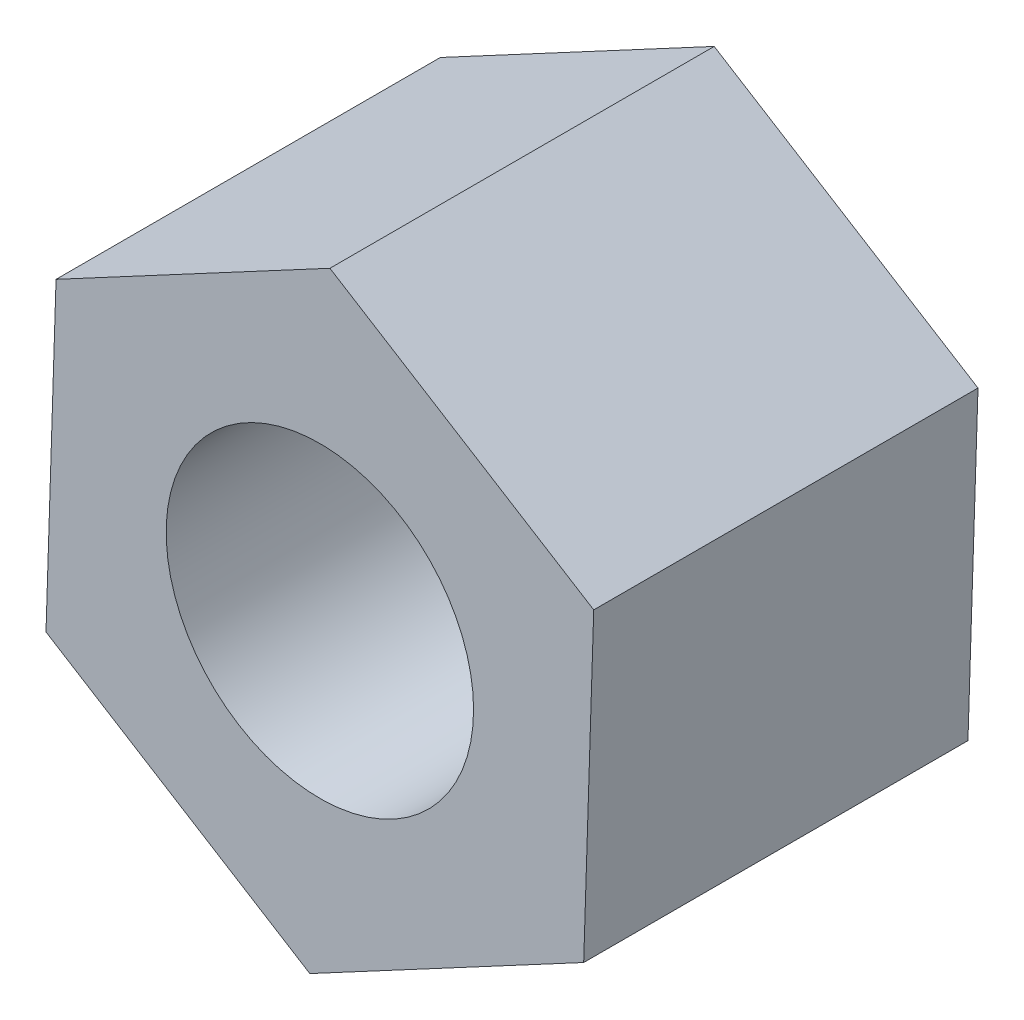
ISO-10303-21;
HEADER;
FILE_DESCRIPTION(('STEP AP214'),'2;1');
FILE_NAME('part.step','',(''),(''),'','','');
FILE_SCHEMA(('AUTOMOTIVE_DESIGN { 1 0 10303 214 1 1 1 1 }'));
ENDSEC;
DATA;
#1=APPLICATION_CONTEXT('core data for automotive mechanical design processes');
#2=APPLICATION_PROTOCOL_DEFINITION('international standard','automotive_design',2000,#1);
#3=PRODUCT_CONTEXT('',#1,'mechanical');
#4=PRODUCT('Part','Part','',(#3));
#5=PRODUCT_RELATED_PRODUCT_CATEGORY('part','',(#4));
#6=PRODUCT_DEFINITION_FORMATION('','',#4);
#7=PRODUCT_DEFINITION_CONTEXT('part definition',#1,'design');
#8=PRODUCT_DEFINITION('design','',#6,#7);
#9=PRODUCT_DEFINITION_SHAPE('','',#8);
#10=(LENGTH_UNIT() NAMED_UNIT(*) SI_UNIT(.MILLI.,.METRE.));
#11=(NAMED_UNIT(*) PLANE_ANGLE_UNIT() SI_UNIT($,.RADIAN.));
#12=(NAMED_UNIT(*) SI_UNIT($,.STERADIAN.) SOLID_ANGLE_UNIT());
#13=UNCERTAINTY_MEASURE_WITH_UNIT(LENGTH_MEASURE(1.E-05),#10,'distance_accuracy_value','');
#14=(GEOMETRIC_REPRESENTATION_CONTEXT(3) GLOBAL_UNCERTAINTY_ASSIGNED_CONTEXT((#13)) GLOBAL_UNIT_ASSIGNED_CONTEXT((#10,
#11,#12)) REPRESENTATION_CONTEXT('',''));
#15=CARTESIAN_POINT('',(0.,0.,0.));
#16=DIRECTION('',(0.,0.,1.));
#17=DIRECTION('',(1.,0.,0.));
#18=AXIS2_PLACEMENT_3D('',#15,#16,#17);
#19=CARTESIAN_POINT('',(5.65719187726186,3.02633972765381,7.9375));
#20=DIRECTION('',(0.,0.,1.));
#21=DIRECTION('',(1.,0.,0.));
#22=AXIS2_PLACEMENT_3D('',#19,#20,#21);
#23=PLANE('',#22);
#24=DIRECTION('',(0.0323745591281024,0.999475806571255,0.));
#25=VECTOR('',#24,1.);
#26=CARTESIAN_POINT('',(5.44948302326121,-3.38610201596485,7.9375));
#27=LINE('',#26,#25);
#28=CARTESIAN_POINT('',(5.44948302326121,-3.38610201596485,7.9375));
#29=VERTEX_POINT('',#28);
#30=CARTESIAN_POINT('',(5.65719187726186,3.02633972765381,7.9375));
#31=VERTEX_POINT('',#30);
#32=EDGE_CURVE('E127',#29,#31,#27,.T.);
#33=ORIENTED_EDGE('',*,*,#32,.T.);
#34=DIRECTION('',(-0.849384159394598,0.527775093926886,0.));
#35=VECTOR('',#34,1.);
#36=CARTESIAN_POINT('',(5.65719187726186,3.02633972765381,7.9375));
#37=LINE('',#36,#35);
#38=CARTESIAN_POINT('',(0.207708854000655,6.41244174361865,7.9375));
#39=VERTEX_POINT('',#38);
#40=EDGE_CURVE('E85',#31,#39,#37,.T.);
#41=ORIENTED_EDGE('',*,*,#40,.T.);
#42=DIRECTION('',(-0.8817587185227,-0.471700712644369,0.));
#43=VECTOR('',#42,1.);
#44=CARTESIAN_POINT('',(0.207708854000655,6.41244174361865,7.9375));
#45=LINE('',#44,#43);
#46=CARTESIAN_POINT('',(-5.44948302326121,3.38610201596485,7.9375));
#47=VERTEX_POINT('',#46);
#48=EDGE_CURVE('E98',#39,#47,#45,.T.);
#49=ORIENTED_EDGE('',*,*,#48,.T.);
#50=DIRECTION('',(-0.0323745591281022,-0.999475806571255,0.));
#51=VECTOR('',#50,1.);
#52=CARTESIAN_POINT('',(-5.44948302326121,3.38610201596485,7.9375));
#53=LINE('',#52,#51);
#54=CARTESIAN_POINT('',(-5.65719187726186,-3.02633972765381,7.9375));
#55=VERTEX_POINT('',#54);
#56=EDGE_CURVE('E92',#47,#55,#53,.T.);
#57=ORIENTED_EDGE('',*,*,#56,.T.);
#58=DIRECTION('',(0.849384159394597,-0.527775093926886,0.));
#59=VECTOR('',#58,1.);
#60=CARTESIAN_POINT('',(-5.65719187726186,-3.02633972765381,7.9375));
#61=LINE('',#60,#59);
#62=CARTESIAN_POINT('',(-0.207708854000651,-6.41244174361865,7.9375));
#63=VERTEX_POINT('',#62);
#64=EDGE_CURVE('E96',#55,#63,#61,.T.);
#65=ORIENTED_EDGE('',*,*,#64,.T.);
#66=DIRECTION('',(0.8817587185227,0.471700712644369,0.));
#67=VECTOR('',#66,1.);
#68=CARTESIAN_POINT('',(-0.207708854000651,-6.41244174361865,7.9375));
#69=LINE('',#68,#67);
#70=EDGE_CURVE('E48',#63,#29,#69,.T.);
#71=ORIENTED_EDGE('',*,*,#70,.T.);
#72=EDGE_LOOP('',(#33,#41,#49,#57,#65,#71));
#73=FACE_BOUND('',#72,.T.);
#74=CARTESIAN_POINT('',(0.,0.,7.9375));
#75=DIRECTION('',(0.,0.,1.));
#76=DIRECTION('',(1.,0.,0.));
#77=AXIS2_PLACEMENT_3D('',#74,#75,#76);
#78=CIRCLE('',#77,3.175);
#79=CARTESIAN_POINT('',(3.175,0.,7.9375));
#80=VERTEX_POINT('',#79);
#81=EDGE_CURVE('E120',#80,#80,#78,.T.);
#82=ORIENTED_EDGE('',*,*,#81,.F.);
#83=EDGE_LOOP('',(#82));
#84=FACE_BOUND('',#83,.T.);
#85=ADVANCED_FACE('F31',(#73,#84),#23,.T.);
#86=CARTESIAN_POINT('',(5.65719187726186,3.02633972765381,0.));
#87=DIRECTION('',(0.,0.,1.));
#88=DIRECTION('',(1.,0.,0.));
#89=AXIS2_PLACEMENT_3D('',#86,#87,#88);
#90=PLANE('',#89);
#91=DIRECTION('',(0.0323745591281024,0.999475806571255,0.));
#92=VECTOR('',#91,1.);
#93=CARTESIAN_POINT('',(5.44948302326121,-3.38610201596485,0.));
#94=LINE('',#93,#92);
#95=CARTESIAN_POINT('',(5.44948302326121,-3.38610201596485,0.));
#96=VERTEX_POINT('',#95);
#97=CARTESIAN_POINT('',(5.65719187726186,3.02633972765381,0.));
#98=VERTEX_POINT('',#97);
#99=EDGE_CURVE('E116',#96,#98,#94,.T.);
#100=ORIENTED_EDGE('',*,*,#99,.F.);
#101=DIRECTION('',(0.8817587185227,0.471700712644369,0.));
#102=VECTOR('',#101,1.);
#103=CARTESIAN_POINT('',(-0.207708854000651,-6.41244174361865,0.));
#104=LINE('',#103,#102);
#105=CARTESIAN_POINT('',(-0.207708854000651,-6.41244174361865,0.));
#106=VERTEX_POINT('',#105);
#107=EDGE_CURVE('E77',#106,#96,#104,.T.);
#108=ORIENTED_EDGE('',*,*,#107,.F.);
#109=DIRECTION('',(0.849384159394597,-0.527775093926886,0.));
#110=VECTOR('',#109,1.);
#111=CARTESIAN_POINT('',(-5.65719187726186,-3.02633972765381,0.));
#112=LINE('',#111,#110);
#113=CARTESIAN_POINT('',(-5.65719187726186,-3.02633972765381,0.));
#114=VERTEX_POINT('',#113);
#115=EDGE_CURVE('E71',#114,#106,#112,.T.);
#116=ORIENTED_EDGE('',*,*,#115,.F.);
#117=DIRECTION('',(-0.0323745591281022,-0.999475806571255,0.));
#118=VECTOR('',#117,1.);
#119=CARTESIAN_POINT('',(-5.44948302326121,3.38610201596485,0.));
#120=LINE('',#119,#118);
#121=CARTESIAN_POINT('',(-5.44948302326121,3.38610201596485,0.));
#122=VERTEX_POINT('',#121);
#123=EDGE_CURVE('E106',#122,#114,#120,.T.);
#124=ORIENTED_EDGE('',*,*,#123,.F.);
#125=DIRECTION('',(-0.8817587185227,-0.471700712644369,0.));
#126=VECTOR('',#125,1.);
#127=CARTESIAN_POINT('',(0.207708854000655,6.41244174361865,0.));
#128=LINE('',#127,#126);
#129=CARTESIAN_POINT('',(0.207708854000655,6.41244174361865,0.));
#130=VERTEX_POINT('',#129);
#131=EDGE_CURVE('E122',#130,#122,#128,.T.);
#132=ORIENTED_EDGE('',*,*,#131,.F.);
#133=DIRECTION('',(-0.849384159394598,0.527775093926886,0.));
#134=VECTOR('',#133,1.);
#135=CARTESIAN_POINT('',(5.65719187726186,3.02633972765381,0.));
#136=LINE('',#135,#134);
#137=EDGE_CURVE('E119',#98,#130,#136,.T.);
#138=ORIENTED_EDGE('',*,*,#137,.F.);
#139=EDGE_LOOP('',(#100,#108,#116,#124,#132,#138));
#140=FACE_BOUND('',#139,.T.);
#141=CARTESIAN_POINT('',(0.,0.,0.));
#142=DIRECTION('',(0.,0.,1.));
#143=DIRECTION('',(1.,0.,0.));
#144=AXIS2_PLACEMENT_3D('',#141,#142,#143);
#145=CIRCLE('',#144,3.175);
#146=CARTESIAN_POINT('',(3.175,0.,0.));
#147=VERTEX_POINT('',#146);
#148=EDGE_CURVE('E220',#147,#147,#145,.T.);
#149=ORIENTED_EDGE('',*,*,#148,.T.);
#150=EDGE_LOOP('',(#149));
#151=FACE_BOUND('',#150,.T.);
#152=ADVANCED_FACE('F136',(#140,#151),#90,.F.);
#153=CARTESIAN_POINT('',(5.44948302326121,-3.38610201596485,7.9375));
#154=DIRECTION('',(-0.999475806571255,0.0323745591281024,0.));
#155=DIRECTION('',(-0.0323745591281024,-0.999475806571255,0.));
#156=AXIS2_PLACEMENT_3D('',#153,#154,#155);
#157=PLANE('',#156);
#158=ORIENTED_EDGE('',*,*,#99,.T.);
#159=DIRECTION('',(0.,0.,-1.));
#160=VECTOR('',#159,1.);
#161=CARTESIAN_POINT('',(5.65719187726186,3.02633972765381,7.9375));
#162=LINE('',#161,#160);
#163=EDGE_CURVE('E11',#31,#98,#162,.T.);
#164=ORIENTED_EDGE('',*,*,#163,.F.);
#165=ORIENTED_EDGE('',*,*,#32,.F.);
#166=DIRECTION('',(0.,0.,-1.));
#167=VECTOR('',#166,1.);
#168=CARTESIAN_POINT('',(5.44948302326121,-3.38610201596485,7.9375));
#169=LINE('',#168,#167);
#170=EDGE_CURVE('E112',#29,#96,#169,.T.);
#171=ORIENTED_EDGE('',*,*,#170,.T.);
#172=EDGE_LOOP('',(#158,#164,#165,#171));
#173=FACE_BOUND('',#172,.T.);
#174=ADVANCED_FACE('F33',(#173),#157,.F.);
#175=CARTESIAN_POINT('',(5.65719187726186,3.02633972765381,7.9375));
#176=DIRECTION('',(-0.527775093926886,-0.849384159394597,0.));
#177=DIRECTION('',(0.849384159394598,-0.527775093926886,0.));
#178=AXIS2_PLACEMENT_3D('',#175,#176,#177);
#179=PLANE('',#178);
#180=ORIENTED_EDGE('',*,*,#137,.T.);
#181=DIRECTION('',(0.,0.,-1.));
#182=VECTOR('',#181,1.);
#183=CARTESIAN_POINT('',(0.207708854000655,6.41244174361865,7.9375));
#184=LINE('',#183,#182);
#185=EDGE_CURVE('E40',#39,#130,#184,.T.);
#186=ORIENTED_EDGE('',*,*,#185,.F.);
#187=ORIENTED_EDGE('',*,*,#40,.F.);
#188=ORIENTED_EDGE('',*,*,#163,.T.);
#189=EDGE_LOOP('',(#180,#186,#187,#188));
#190=FACE_BOUND('',#189,.T.);
#191=ADVANCED_FACE('F161',(#190),#179,.F.);
#192=CARTESIAN_POINT('',(0.207708854000655,6.41244174361865,7.9375));
#193=DIRECTION('',(0.471700712644369,-0.8817587185227,0.));
#194=DIRECTION('',(0.8817587185227,0.471700712644369,0.));
#195=AXIS2_PLACEMENT_3D('',#192,#193,#194);
#196=PLANE('',#195);
#197=ORIENTED_EDGE('',*,*,#131,.T.);
#198=DIRECTION('',(0.,0.,-1.));
#199=VECTOR('',#198,1.);
#200=CARTESIAN_POINT('',(-5.44948302326121,3.38610201596485,7.9375));
#201=LINE('',#200,#199);
#202=EDGE_CURVE('E107',#47,#122,#201,.T.);
#203=ORIENTED_EDGE('',*,*,#202,.F.);
#204=ORIENTED_EDGE('',*,*,#48,.F.);
#205=ORIENTED_EDGE('',*,*,#185,.T.);
#206=EDGE_LOOP('',(#197,#203,#204,#205));
#207=FACE_BOUND('',#206,.T.);
#208=ADVANCED_FACE('F133',(#207),#196,.F.);
#209=CARTESIAN_POINT('',(-5.44948302326121,3.38610201596485,7.9375));
#210=DIRECTION('',(0.999475806571255,-0.0323745591281022,0.));
#211=DIRECTION('',(0.0323745591281022,0.999475806571255,0.));
#212=AXIS2_PLACEMENT_3D('',#209,#210,#211);
#213=PLANE('',#212);
#214=ORIENTED_EDGE('',*,*,#123,.T.);
#215=DIRECTION('',(0.,0.,-1.));
#216=VECTOR('',#215,1.);
#217=CARTESIAN_POINT('',(-5.65719187726186,-3.02633972765381,7.9375));
#218=LINE('',#217,#216);
#219=EDGE_CURVE('E103',#55,#114,#218,.T.);
#220=ORIENTED_EDGE('',*,*,#219,.F.);
#221=ORIENTED_EDGE('',*,*,#56,.F.);
#222=ORIENTED_EDGE('',*,*,#202,.T.);
#223=EDGE_LOOP('',(#214,#220,#221,#222));
#224=FACE_BOUND('',#223,.T.);
#225=ADVANCED_FACE('F104',(#224),#213,.F.);
#226=CARTESIAN_POINT('',(-5.65719187726186,-3.02633972765381,7.9375));
#227=DIRECTION('',(0.527775093926886,0.849384159394597,0.));
#228=DIRECTION('',(-0.849384159394597,0.527775093926886,0.));
#229=AXIS2_PLACEMENT_3D('',#226,#227,#228);
#230=PLANE('',#229);
#231=ORIENTED_EDGE('',*,*,#115,.T.);
#232=DIRECTION('',(0.,0.,-1.));
#233=VECTOR('',#232,1.);
#234=CARTESIAN_POINT('',(-0.207708854000651,-6.41244174361865,7.9375));
#235=LINE('',#234,#233);
#236=EDGE_CURVE('E108',#63,#106,#235,.T.);
#237=ORIENTED_EDGE('',*,*,#236,.F.);
#238=ORIENTED_EDGE('',*,*,#64,.F.);
#239=ORIENTED_EDGE('',*,*,#219,.T.);
#240=EDGE_LOOP('',(#231,#237,#238,#239));
#241=FACE_BOUND('',#240,.T.);
#242=ADVANCED_FACE('F110',(#241),#230,.F.);
#243=CARTESIAN_POINT('',(-0.207708854000651,-6.41244174361865,7.9375));
#244=DIRECTION('',(-0.471700712644369,0.8817587185227,0.));
#245=DIRECTION('',(-0.8817587185227,-0.471700712644369,0.));
#246=AXIS2_PLACEMENT_3D('',#243,#244,#245);
#247=PLANE('',#246);
#248=ORIENTED_EDGE('',*,*,#107,.T.);
#249=ORIENTED_EDGE('',*,*,#170,.F.);
#250=ORIENTED_EDGE('',*,*,#70,.F.);
#251=ORIENTED_EDGE('',*,*,#236,.T.);
#252=EDGE_LOOP('',(#248,#249,#250,#251));
#253=FACE_BOUND('',#252,.T.);
#254=ADVANCED_FACE('F141',(#253),#247,.F.);
#255=CARTESIAN_POINT('',(0.,0.,7.9375));
#256=DIRECTION('',(0.,0.,-1.));
#257=DIRECTION('',(-1.,0.,0.));
#258=AXIS2_PLACEMENT_3D('',#255,#256,#257);
#259=CYLINDRICAL_SURFACE('',#258,3.175);
#260=ORIENTED_EDGE('',*,*,#81,.T.);
#261=EDGE_LOOP('',(#260));
#262=FACE_BOUND('',#261,.T.);
#263=ORIENTED_EDGE('',*,*,#148,.F.);
#264=EDGE_LOOP('',(#263));
#265=FACE_BOUND('',#264,.T.);
#266=ADVANCED_FACE('F143',(#262,#265),#259,.F.);
#267=CLOSED_SHELL('',(#85,#152,#174,#191,#208,#225,#242,#254,#266));
#268=MANIFOLD_SOLID_BREP('B2',#267);
#269=ADVANCED_BREP_SHAPE_REPRESENTATION('',(#18,#268),#14);
#270=SHAPE_DEFINITION_REPRESENTATION(#9,#269);
ENDSEC;
END-ISO-10303-21;
